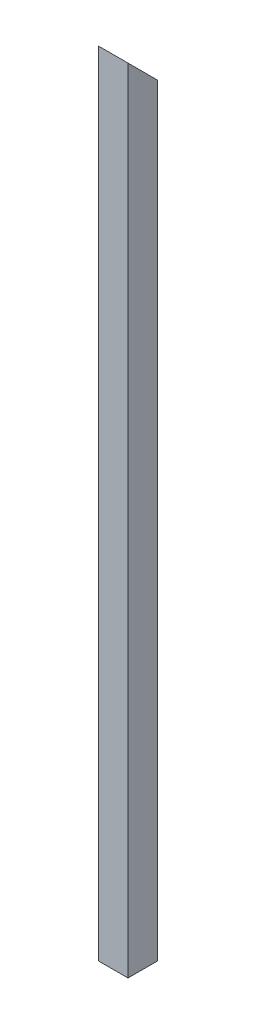
ISO-10303-21;
HEADER;
FILE_DESCRIPTION(('STEP AP214'),'2;1');
FILE_NAME('part.step','',(''),(''),'','','');
FILE_SCHEMA(('AUTOMOTIVE_DESIGN { 1 0 10303 214 1 1 1 1 }'));
ENDSEC;
DATA;
#1=APPLICATION_CONTEXT('core data for automotive mechanical design processes');
#2=APPLICATION_PROTOCOL_DEFINITION('international standard','automotive_design',2000,#1);
#3=PRODUCT_CONTEXT('',#1,'mechanical');
#4=PRODUCT('Part','Part','',(#3));
#5=PRODUCT_RELATED_PRODUCT_CATEGORY('part','',(#4));
#6=PRODUCT_DEFINITION_FORMATION('','',#4);
#7=PRODUCT_DEFINITION_CONTEXT('part definition',#1,'design');
#8=PRODUCT_DEFINITION('design','',#6,#7);
#9=PRODUCT_DEFINITION_SHAPE('','',#8);
#10=(LENGTH_UNIT() NAMED_UNIT(*) SI_UNIT(.MILLI.,.METRE.));
#11=(NAMED_UNIT(*) PLANE_ANGLE_UNIT() SI_UNIT($,.RADIAN.));
#12=(NAMED_UNIT(*) SI_UNIT($,.STERADIAN.) SOLID_ANGLE_UNIT());
#13=UNCERTAINTY_MEASURE_WITH_UNIT(LENGTH_MEASURE(1.E-05),#10,'distance_accuracy_value','');
#14=(GEOMETRIC_REPRESENTATION_CONTEXT(3) GLOBAL_UNCERTAINTY_ASSIGNED_CONTEXT((#13)) GLOBAL_UNIT_ASSIGNED_CONTEXT((#10,
#11,#12)) REPRESENTATION_CONTEXT('',''));
#15=CARTESIAN_POINT('',(0.,0.,0.));
#16=DIRECTION('',(0.,0.,1.));
#17=DIRECTION('',(1.,0.,0.));
#18=AXIS2_PLACEMENT_3D('',#15,#16,#17);
#19=CARTESIAN_POINT('',(9.525,533.4,9.525));
#20=DIRECTION('',(-1.,0.,0.));
#21=DIRECTION('',(0.,0.,1.));
#22=AXIS2_PLACEMENT_3D('',#19,#20,#21);
#23=PLANE('',#22);
#24=DIRECTION('',(0.,-1.,0.));
#25=VECTOR('',#24,1.);
#26=CARTESIAN_POINT('',(9.525,533.4,-9.525));
#27=LINE('',#26,#25);
#28=CARTESIAN_POINT('',(9.525,491.735111143189,-9.525));
#29=VERTEX_POINT('',#28);
#30=CARTESIAN_POINT('',(9.525,0.,-9.525));
#31=VERTEX_POINT('',#30);
#32=EDGE_CURVE('E11',#29,#31,#27,.T.);
#33=ORIENTED_EDGE('',*,*,#32,.F.);
#34=DIRECTION('',(0.,-0.707106781186547,-0.707106781186548));
#35=VECTOR('',#34,1.);
#36=CARTESIAN_POINT('',(9.525,491.735111143189,-9.525));
#37=LINE('',#36,#35);
#38=CARTESIAN_POINT('',(9.525,510.785111143189,9.525));
#39=VERTEX_POINT('',#38);
#40=EDGE_CURVE('E78',#39,#29,#37,.T.);
#41=ORIENTED_EDGE('',*,*,#40,.F.);
#42=DIRECTION('',(0.,-1.,0.));
#43=VECTOR('',#42,1.);
#44=CARTESIAN_POINT('',(9.525,533.4,9.525));
#45=LINE('',#44,#43);
#46=CARTESIAN_POINT('',(9.525,0.,9.525));
#47=VERTEX_POINT('',#46);
#48=EDGE_CURVE('E59',#39,#47,#45,.T.);
#49=ORIENTED_EDGE('',*,*,#48,.T.);
#50=DIRECTION('',(0.,0.,-1.));
#51=VECTOR('',#50,1.);
#52=CARTESIAN_POINT('',(9.525,0.,9.525));
#53=LINE('',#52,#51);
#54=EDGE_CURVE('E82',#47,#31,#53,.T.);
#55=ORIENTED_EDGE('',*,*,#54,.T.);
#56=EDGE_LOOP('',(#33,#41,#49,#55));
#57=FACE_BOUND('',#56,.T.);
#58=ADVANCED_FACE('F37',(#57),#23,.F.);
#59=CARTESIAN_POINT('',(-9.52500000000001,533.4,-9.525));
#60=DIRECTION('',(0.,0.,1.));
#61=DIRECTION('',(1.,0.,0.));
#62=AXIS2_PLACEMENT_3D('',#59,#60,#61);
#63=PLANE('',#62);
#64=DIRECTION('',(0.,-1.,0.));
#65=VECTOR('',#64,1.);
#66=CARTESIAN_POINT('',(-9.52500000000001,533.4,-9.525));
#67=LINE('',#66,#65);
#68=CARTESIAN_POINT('',(-9.52500000000001,491.735111143189,-9.525));
#69=VERTEX_POINT('',#68);
#70=CARTESIAN_POINT('',(-9.52500000000001,0.,-9.525));
#71=VERTEX_POINT('',#70);
#72=EDGE_CURVE('E44',#69,#71,#67,.T.);
#73=ORIENTED_EDGE('',*,*,#72,.F.);
#74=DIRECTION('',(1.,0.,0.));
#75=VECTOR('',#74,1.);
#76=CARTESIAN_POINT('',(-9.52500000000001,491.735111143189,-9.525));
#77=LINE('',#76,#75);
#78=EDGE_CURVE('E76',#69,#29,#77,.T.);
#79=ORIENTED_EDGE('',*,*,#78,.T.);
#80=ORIENTED_EDGE('',*,*,#32,.T.);
#81=DIRECTION('',(-1.,0.,0.));
#82=VECTOR('',#81,1.);
#83=CARTESIAN_POINT('',(-9.52500000000001,0.,-9.525));
#84=LINE('',#83,#82);
#85=EDGE_CURVE('E94',#31,#71,#84,.T.);
#86=ORIENTED_EDGE('',*,*,#85,.T.);
#87=EDGE_LOOP('',(#73,#79,#80,#86));
#88=FACE_BOUND('',#87,.T.);
#89=ADVANCED_FACE('F92',(#88),#63,.F.);
#90=CARTESIAN_POINT('',(-9.52500000000001,533.4,9.525));
#91=DIRECTION('',(1.,0.,0.));
#92=DIRECTION('',(0.,0.,-1.));
#93=AXIS2_PLACEMENT_3D('',#90,#91,#92);
#94=PLANE('',#93);
#95=DIRECTION('',(0.,-1.,0.));
#96=VECTOR('',#95,1.);
#97=CARTESIAN_POINT('',(-9.52500000000001,533.4,9.525));
#98=LINE('',#97,#96);
#99=CARTESIAN_POINT('',(-9.52500000000001,510.785111143189,9.525));
#100=VERTEX_POINT('',#99);
#101=CARTESIAN_POINT('',(-9.52500000000001,0.,9.525));
#102=VERTEX_POINT('',#101);
#103=EDGE_CURVE('E90',#100,#102,#98,.T.);
#104=ORIENTED_EDGE('',*,*,#103,.F.);
#105=DIRECTION('',(0.,-0.707106781186547,-0.707106781186548));
#106=VECTOR('',#105,1.);
#107=CARTESIAN_POINT('',(-9.52500000000001,491.735111143189,-9.525));
#108=LINE('',#107,#106);
#109=EDGE_CURVE('E51',#100,#69,#108,.T.);
#110=ORIENTED_EDGE('',*,*,#109,.T.);
#111=ORIENTED_EDGE('',*,*,#72,.T.);
#112=DIRECTION('',(0.,0.,1.));
#113=VECTOR('',#112,1.);
#114=CARTESIAN_POINT('',(-9.52500000000001,0.,9.525));
#115=LINE('',#114,#113);
#116=EDGE_CURVE('E101',#71,#102,#115,.T.);
#117=ORIENTED_EDGE('',*,*,#116,.T.);
#118=EDGE_LOOP('',(#104,#110,#111,#117));
#119=FACE_BOUND('',#118,.T.);
#120=ADVANCED_FACE('F87',(#119),#94,.F.);
#121=CARTESIAN_POINT('',(-9.52500000000001,533.4,9.525));
#122=DIRECTION('',(0.,0.,-1.));
#123=DIRECTION('',(-1.,0.,0.));
#124=AXIS2_PLACEMENT_3D('',#121,#122,#123);
#125=PLANE('',#124);
#126=ORIENTED_EDGE('',*,*,#48,.F.);
#127=DIRECTION('',(1.,0.,0.));
#128=VECTOR('',#127,1.);
#129=CARTESIAN_POINT('',(-9.52500000000001,510.785111143189,9.525));
#130=LINE('',#129,#128);
#131=EDGE_CURVE('E83',#100,#39,#130,.T.);
#132=ORIENTED_EDGE('',*,*,#131,.F.);
#133=ORIENTED_EDGE('',*,*,#103,.T.);
#134=DIRECTION('',(1.,0.,0.));
#135=VECTOR('',#134,1.);
#136=CARTESIAN_POINT('',(-9.52500000000001,0.,9.525));
#137=LINE('',#136,#135);
#138=EDGE_CURVE('E99',#102,#47,#137,.T.);
#139=ORIENTED_EDGE('',*,*,#138,.T.);
#140=EDGE_LOOP('',(#126,#132,#133,#139));
#141=FACE_BOUND('',#140,.T.);
#142=ADVANCED_FACE('F107',(#141),#125,.F.);
#143=CARTESIAN_POINT('',(0.,0.,0.));
#144=DIRECTION('',(0.,-1.,0.));
#145=DIRECTION('',(0.,0.,-1.));
#146=AXIS2_PLACEMENT_3D('',#143,#144,#145);
#147=PLANE('',#146);
#148=ORIENTED_EDGE('',*,*,#54,.F.);
#149=ORIENTED_EDGE('',*,*,#138,.F.);
#150=ORIENTED_EDGE('',*,*,#116,.F.);
#151=ORIENTED_EDGE('',*,*,#85,.F.);
#152=EDGE_LOOP('',(#148,#149,#150,#151));
#153=FACE_BOUND('',#152,.T.);
#154=ADVANCED_FACE('F111',(#153),#147,.T.);
#155=CARTESIAN_POINT('',(-9.52500000000001,491.735111143189,-9.525));
#156=DIRECTION('',(0.,-0.707106781186548,0.707106781186547));
#157=DIRECTION('',(0.,-0.707106781186547,-0.707106781186548));
#158=AXIS2_PLACEMENT_3D('',#155,#156,#157);
#159=PLANE('',#158);
#160=ORIENTED_EDGE('',*,*,#40,.T.);
#161=ORIENTED_EDGE('',*,*,#78,.F.);
#162=ORIENTED_EDGE('',*,*,#109,.F.);
#163=ORIENTED_EDGE('',*,*,#131,.T.);
#164=EDGE_LOOP('',(#160,#161,#162,#163));
#165=FACE_BOUND('',#164,.T.);
#166=ADVANCED_FACE('F77',(#165),#159,.F.);
#167=CLOSED_SHELL('',(#58,#89,#120,#142,#154,#166));
#168=MANIFOLD_SOLID_BREP('B2',#167);
#169=ADVANCED_BREP_SHAPE_REPRESENTATION('',(#18,#168),#14);
#170=SHAPE_DEFINITION_REPRESENTATION(#9,#169);
ENDSEC;
END-ISO-10303-21;
